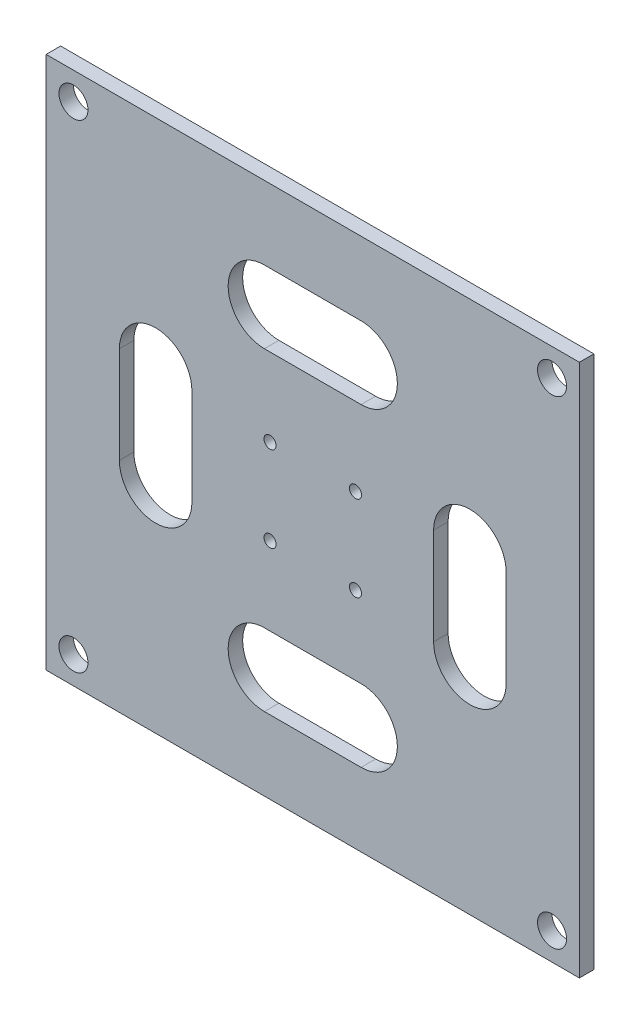
ISO-10303-21;
HEADER;
FILE_DESCRIPTION(('STEP AP214'),'2;1');
FILE_NAME('part.step','',(''),(''),'','','');
FILE_SCHEMA(('AUTOMOTIVE_DESIGN { 1 0 10303 214 1 1 1 1 }'));
ENDSEC;
DATA;
#1=APPLICATION_CONTEXT('core data for automotive mechanical design processes');
#2=APPLICATION_PROTOCOL_DEFINITION('international standard','automotive_design',2000,#1);
#3=PRODUCT_CONTEXT('',#1,'mechanical');
#4=PRODUCT('Part','Part','',(#3));
#5=PRODUCT_RELATED_PRODUCT_CATEGORY('part','',(#4));
#6=PRODUCT_DEFINITION_FORMATION('','',#4);
#7=PRODUCT_DEFINITION_CONTEXT('part definition',#1,'design');
#8=PRODUCT_DEFINITION('design','',#6,#7);
#9=PRODUCT_DEFINITION_SHAPE('','',#8);
#10=(LENGTH_UNIT() NAMED_UNIT(*) SI_UNIT(.MILLI.,.METRE.));
#11=(NAMED_UNIT(*) PLANE_ANGLE_UNIT() SI_UNIT($,.RADIAN.));
#12=(NAMED_UNIT(*) SI_UNIT($,.STERADIAN.) SOLID_ANGLE_UNIT());
#13=UNCERTAINTY_MEASURE_WITH_UNIT(LENGTH_MEASURE(1.E-05),#10,'distance_accuracy_value','');
#14=(GEOMETRIC_REPRESENTATION_CONTEXT(3) GLOBAL_UNCERTAINTY_ASSIGNED_CONTEXT((#13)) GLOBAL_UNIT_ASSIGNED_CONTEXT((#10,
#11,#12)) REPRESENTATION_CONTEXT('',''));
#15=CARTESIAN_POINT('',(0.,0.,0.));
#16=DIRECTION('',(0.,0.,1.));
#17=DIRECTION('',(1.,0.,0.));
#18=AXIS2_PLACEMENT_3D('',#15,#16,#17);
#19=CARTESIAN_POINT('',(0.,0.,3.));
#20=DIRECTION('',(0.,0.,1.));
#21=DIRECTION('',(1.,0.,0.));
#22=AXIS2_PLACEMENT_3D('',#19,#20,#21);
#23=PLANE('',#22);
#24=CARTESIAN_POINT('',(49.4974746830449,-49.4974746830718,3.));
#25=DIRECTION('',(0.,0.,1.));
#26=DIRECTION('',(1.,0.,0.));
#27=AXIS2_PLACEMENT_3D('',#24,#25,#26);
#28=CIRCLE('',#27,3.0000000000168);
#29=CARTESIAN_POINT('',(52.4974746830617,-49.4974746830718,3.));
#30=VERTEX_POINT('',#29);
#31=EDGE_CURVE('E311',#30,#30,#28,.T.);
#32=ORIENTED_EDGE('',*,*,#31,.F.);
#33=EDGE_LOOP('',(#32));
#34=FACE_BOUND('',#33,.T.);
#35=CARTESIAN_POINT('',(-49.4974746830448,49.4974746830718,3.));
#36=DIRECTION('',(0.,0.,1.));
#37=DIRECTION('',(1.,0.,0.));
#38=AXIS2_PLACEMENT_3D('',#35,#36,#37);
#39=CIRCLE('',#38,2.99999999998317);
#40=CARTESIAN_POINT('',(-46.4974746830617,49.4974746830718,3.));
#41=VERTEX_POINT('',#40);
#42=EDGE_CURVE('E323',#41,#41,#39,.T.);
#43=ORIENTED_EDGE('',*,*,#42,.F.);
#44=EDGE_LOOP('',(#43));
#45=FACE_BOUND('',#44,.T.);
#46=CARTESIAN_POINT('',(8.83883476483184,-8.83883476483195,3.));
#47=DIRECTION('',(0.,0.,1.));
#48=DIRECTION('',(1.,0.,0.));
#49=AXIS2_PLACEMENT_3D('',#46,#47,#48);
#50=CIRCLE('',#49,1.24999999999912);
#51=CARTESIAN_POINT('',(10.088834764831,-8.83883476483195,3.));
#52=VERTEX_POINT('',#51);
#53=EDGE_CURVE('E335',#52,#52,#50,.T.);
#54=ORIENTED_EDGE('',*,*,#53,.F.);
#55=EDGE_LOOP('',(#54));
#56=FACE_BOUND('',#55,.T.);
#57=CARTESIAN_POINT('',(-8.83883476483184,8.83883476483195,3.));
#58=DIRECTION('',(0.,0.,1.));
#59=DIRECTION('',(1.,0.,0.));
#60=AXIS2_PLACEMENT_3D('',#57,#58,#59);
#61=CIRCLE('',#60,1.25);
#62=CARTESIAN_POINT('',(-7.58883476483184,8.83883476483195,3.));
#63=VERTEX_POINT('',#62);
#64=EDGE_CURVE('E347',#63,#63,#61,.T.);
#65=ORIENTED_EDGE('',*,*,#64,.F.);
#66=EDGE_LOOP('',(#65));
#67=FACE_BOUND('',#66,.T.);
#68=DIRECTION('',(0.,1.,0.));
#69=VECTOR('',#68,1.);
#70=CARTESIAN_POINT('',(55.1543289325508,-55.1543289325506,3.));
#71=LINE('',#70,#69);
#72=CARTESIAN_POINT('',(55.1543289325508,-55.1543289325506,3.));
#73=VERTEX_POINT('',#72);
#74=CARTESIAN_POINT('',(55.1543289325506,55.1543289325508,3.));
#75=VERTEX_POINT('',#74);
#76=EDGE_CURVE('E353',#73,#75,#71,.T.);
#77=ORIENTED_EDGE('',*,*,#76,.T.);
#78=DIRECTION('',(-1.,0.,0.));
#79=VECTOR('',#78,1.);
#80=CARTESIAN_POINT('',(55.1543289325506,55.1543289325508,3.));
#81=LINE('',#80,#79);
#82=CARTESIAN_POINT('',(-55.1543289325508,55.1543289325506,3.));
#83=VERTEX_POINT('',#82);
#84=EDGE_CURVE('E356',#75,#83,#81,.T.);
#85=ORIENTED_EDGE('',*,*,#84,.T.);
#86=DIRECTION('',(0.,-1.,0.));
#87=VECTOR('',#86,1.);
#88=CARTESIAN_POINT('',(-55.1543289325508,55.1543289325506,3.));
#89=LINE('',#88,#87);
#90=CARTESIAN_POINT('',(-55.1543289325506,-55.1543289325508,3.));
#91=VERTEX_POINT('',#90);
#92=EDGE_CURVE('E359',#83,#91,#89,.T.);
#93=ORIENTED_EDGE('',*,*,#92,.T.);
#94=DIRECTION('',(1.,0.,0.));
#95=VECTOR('',#94,1.);
#96=CARTESIAN_POINT('',(-55.1543289325506,-55.1543289325508,3.));
#97=LINE('',#96,#95);
#98=EDGE_CURVE('E361',#91,#73,#97,.T.);
#99=ORIENTED_EDGE('',*,*,#98,.T.);
#100=EDGE_LOOP('',(#77,#85,#93,#99));
#101=FACE_BOUND('',#100,.T.);
#102=CARTESIAN_POINT('',(8.83883476483186,8.83883476483193,3.));
#103=DIRECTION('',(0.,0.,1.));
#104=DIRECTION('',(-1.,0.,0.));
#105=AXIS2_PLACEMENT_3D('',#102,#103,#104);
#106=CIRCLE('',#105,1.25);
#107=CARTESIAN_POINT('',(7.58883476483186,8.83883476483193,3.));
#108=VERTEX_POINT('',#107);
#109=EDGE_CURVE('E341',#108,#108,#106,.T.);
#110=ORIENTED_EDGE('',*,*,#109,.F.);
#111=EDGE_LOOP('',(#110));
#112=FACE_BOUND('',#111,.T.);
#113=CARTESIAN_POINT('',(-8.83883476483184,-8.83883476483195,3.));
#114=DIRECTION('',(0.,0.,1.));
#115=DIRECTION('',(-1.,0.,0.));
#116=AXIS2_PLACEMENT_3D('',#113,#114,#115);
#117=CIRCLE('',#116,1.25000000000086);
#118=CARTESIAN_POINT('',(-10.0888347648327,-8.83883476483195,3.));
#119=VERTEX_POINT('',#118);
#120=EDGE_CURVE('E329',#119,#119,#117,.T.);
#121=ORIENTED_EDGE('',*,*,#120,.F.);
#122=EDGE_LOOP('',(#121));
#123=FACE_BOUND('',#122,.T.);
#124=CARTESIAN_POINT('',(49.4974746830718,49.4974746830448,3.));
#125=DIRECTION('',(0.,0.,1.));
#126=DIRECTION('',(1.,0.,0.));
#127=AXIS2_PLACEMENT_3D('',#124,#125,#126);
#128=CIRCLE('',#127,2.99999999999104);
#129=CARTESIAN_POINT('',(52.4974746830628,49.4974746830448,3.));
#130=VERTEX_POINT('',#129);
#131=EDGE_CURVE('E317',#130,#130,#128,.T.);
#132=ORIENTED_EDGE('',*,*,#131,.F.);
#133=EDGE_LOOP('',(#132));
#134=FACE_BOUND('',#133,.T.);
#135=CARTESIAN_POINT('',(-49.4974746830718,-49.4974746830448,3.));
#136=DIRECTION('',(0.,0.,1.));
#137=DIRECTION('',(1.,0.,0.));
#138=AXIS2_PLACEMENT_3D('',#135,#136,#137);
#139=CIRCLE('',#138,3.00000000000891);
#140=CARTESIAN_POINT('',(-46.4974746830629,-49.4974746830448,3.));
#141=VERTEX_POINT('',#140);
#142=EDGE_CURVE('E305',#141,#141,#139,.T.);
#143=ORIENTED_EDGE('',*,*,#142,.F.);
#144=EDGE_LOOP('',(#143));
#145=FACE_BOUND('',#144,.T.);
#146=DIRECTION('',(0.,1.,0.));
#147=VECTOR('',#146,1.);
#148=CARTESIAN_POINT('',(-25.,-9.99999999999994,3.));
#149=LINE('',#148,#147);
#150=CARTESIAN_POINT('',(-25.,-9.99999999999994,3.));
#151=VERTEX_POINT('',#150);
#152=CARTESIAN_POINT('',(-25.,10.0000000000001,3.));
#153=VERTEX_POINT('',#152);
#154=EDGE_CURVE('E276',#151,#153,#149,.T.);
#155=ORIENTED_EDGE('',*,*,#154,.F.);
#156=CARTESIAN_POINT('',(-32.5,-9.99999999999992,3.));
#157=DIRECTION('',(0.,0.,1.));
#158=DIRECTION('',(-1.,0.,0.));
#159=AXIS2_PLACEMENT_3D('',#156,#157,#158);
#160=CIRCLE('',#159,7.5);
#161=CARTESIAN_POINT('',(-40.,-9.9999999999999,3.));
#162=VERTEX_POINT('',#161);
#163=EDGE_CURVE('E274',#162,#151,#160,.T.);
#164=ORIENTED_EDGE('',*,*,#163,.F.);
#165=DIRECTION('',(0.,-1.,0.));
#166=VECTOR('',#165,1.);
#167=CARTESIAN_POINT('',(-40.,-9.9999999999999,3.));
#168=LINE('',#167,#166);
#169=CARTESIAN_POINT('',(-40.,10.0000000000001,3.));
#170=VERTEX_POINT('',#169);
#171=EDGE_CURVE('E282',#170,#162,#168,.T.);
#172=ORIENTED_EDGE('',*,*,#171,.F.);
#173=CARTESIAN_POINT('',(-32.5,10.0000000000001,3.));
#174=DIRECTION('',(0.,0.,1.));
#175=DIRECTION('',(-1.,0.,0.));
#176=AXIS2_PLACEMENT_3D('',#173,#174,#175);
#177=CIRCLE('',#176,7.5);
#178=EDGE_CURVE('E279',#153,#170,#177,.T.);
#179=ORIENTED_EDGE('',*,*,#178,.F.);
#180=EDGE_LOOP('',(#155,#164,#172,#179));
#181=FACE_BOUND('',#180,.T.);
#182=DIRECTION('',(0.,1.,0.));
#183=VECTOR('',#182,1.);
#184=CARTESIAN_POINT('',(40.,-10.,3.));
#185=LINE('',#184,#183);
#186=CARTESIAN_POINT('',(40.,-10.,3.));
#187=VERTEX_POINT('',#186);
#188=CARTESIAN_POINT('',(40.,10.,3.));
#189=VERTEX_POINT('',#188);
#190=EDGE_CURVE('E245',#187,#189,#185,.T.);
#191=ORIENTED_EDGE('',*,*,#190,.F.);
#192=CARTESIAN_POINT('',(32.5,-10.,3.));
#193=DIRECTION('',(0.,0.,1.));
#194=DIRECTION('',(1.,0.,0.));
#195=AXIS2_PLACEMENT_3D('',#192,#193,#194);
#196=CIRCLE('',#195,7.5);
#197=CARTESIAN_POINT('',(25.,-10.,3.));
#198=VERTEX_POINT('',#197);
#199=EDGE_CURVE('E243',#198,#187,#196,.T.);
#200=ORIENTED_EDGE('',*,*,#199,.F.);
#201=DIRECTION('',(0.,-1.,0.));
#202=VECTOR('',#201,1.);
#203=CARTESIAN_POINT('',(25.,-10.,3.));
#204=LINE('',#203,#202);
#205=CARTESIAN_POINT('',(25.,10.,3.));
#206=VERTEX_POINT('',#205);
#207=EDGE_CURVE('E251',#206,#198,#204,.T.);
#208=ORIENTED_EDGE('',*,*,#207,.F.);
#209=CARTESIAN_POINT('',(32.5,10.,3.));
#210=DIRECTION('',(0.,0.,1.));
#211=DIRECTION('',(1.,0.,0.));
#212=AXIS2_PLACEMENT_3D('',#209,#210,#211);
#213=CIRCLE('',#212,7.5);
#214=EDGE_CURVE('E248',#189,#206,#213,.T.);
#215=ORIENTED_EDGE('',*,*,#214,.F.);
#216=EDGE_LOOP('',(#191,#200,#208,#215));
#217=FACE_BOUND('',#216,.T.);
#218=DIRECTION('',(1.,0.,0.));
#219=VECTOR('',#218,1.);
#220=CARTESIAN_POINT('',(-10.,25.0000000000001,3.));
#221=LINE('',#220,#219);
#222=CARTESIAN_POINT('',(-10.,25.0000000000001,3.));
#223=VERTEX_POINT('',#222);
#224=CARTESIAN_POINT('',(10.,25.0000000000001,3.));
#225=VERTEX_POINT('',#224);
#226=EDGE_CURVE('E214',#223,#225,#221,.T.);
#227=ORIENTED_EDGE('',*,*,#226,.F.);
#228=CARTESIAN_POINT('',(-10.,32.5000000000001,3.));
#229=DIRECTION('',(0.,0.,1.));
#230=DIRECTION('',(1.,0.,0.));
#231=AXIS2_PLACEMENT_3D('',#228,#229,#230);
#232=CIRCLE('',#231,7.5);
#233=CARTESIAN_POINT('',(-10.,40.0000000000001,3.));
#234=VERTEX_POINT('',#233);
#235=EDGE_CURVE('E212',#234,#223,#232,.T.);
#236=ORIENTED_EDGE('',*,*,#235,.F.);
#237=DIRECTION('',(-1.,0.,0.));
#238=VECTOR('',#237,1.);
#239=CARTESIAN_POINT('',(-10.,40.0000000000001,3.));
#240=LINE('',#239,#238);
#241=CARTESIAN_POINT('',(10.,40.0000000000001,3.));
#242=VERTEX_POINT('',#241);
#243=EDGE_CURVE('E220',#242,#234,#240,.T.);
#244=ORIENTED_EDGE('',*,*,#243,.F.);
#245=CARTESIAN_POINT('',(10.,32.5000000000001,3.));
#246=DIRECTION('',(0.,0.,1.));
#247=DIRECTION('',(1.,0.,0.));
#248=AXIS2_PLACEMENT_3D('',#245,#246,#247);
#249=CIRCLE('',#248,7.5);
#250=EDGE_CURVE('E217',#225,#242,#249,.T.);
#251=ORIENTED_EDGE('',*,*,#250,.F.);
#252=EDGE_LOOP('',(#227,#236,#244,#251));
#253=FACE_BOUND('',#252,.T.);
#254=DIRECTION('',(1.,0.,0.));
#255=VECTOR('',#254,1.);
#256=CARTESIAN_POINT('',(-10.,-40.0000000000001,3.));
#257=LINE('',#256,#255);
#258=CARTESIAN_POINT('',(-10.,-40.0000000000001,3.));
#259=VERTEX_POINT('',#258);
#260=CARTESIAN_POINT('',(10.,-40.0000000000001,3.));
#261=VERTEX_POINT('',#260);
#262=EDGE_CURVE('E184',#259,#261,#257,.T.);
#263=ORIENTED_EDGE('',*,*,#262,.F.);
#264=CARTESIAN_POINT('',(-10.,-32.5000000000001,3.));
#265=DIRECTION('',(0.,0.,1.));
#266=DIRECTION('',(-1.,0.,0.));
#267=AXIS2_PLACEMENT_3D('',#264,#265,#266);
#268=CIRCLE('',#267,7.5);
#269=CARTESIAN_POINT('',(-10.,-25.0000000000001,3.));
#270=VERTEX_POINT('',#269);
#271=EDGE_CURVE('E176',#270,#259,#268,.T.);
#272=ORIENTED_EDGE('',*,*,#271,.F.);
#273=DIRECTION('',(-1.,0.,0.));
#274=VECTOR('',#273,1.);
#275=CARTESIAN_POINT('',(-10.,-25.0000000000001,3.));
#276=LINE('',#275,#274);
#277=CARTESIAN_POINT('',(10.,-25.0000000000001,3.));
#278=VERTEX_POINT('',#277);
#279=EDGE_CURVE('E198',#278,#270,#276,.T.);
#280=ORIENTED_EDGE('',*,*,#279,.F.);
#281=CARTESIAN_POINT('',(10.,-32.5000000000001,3.));
#282=DIRECTION('',(0.,0.,1.));
#283=DIRECTION('',(-1.,0.,0.));
#284=AXIS2_PLACEMENT_3D('',#281,#282,#283);
#285=CIRCLE('',#284,7.5);
#286=EDGE_CURVE('E196',#261,#278,#285,.T.);
#287=ORIENTED_EDGE('',*,*,#286,.F.);
#288=EDGE_LOOP('',(#263,#272,#280,#287));
#289=FACE_BOUND('',#288,.T.);
#290=ADVANCED_FACE('F39',(#34,#45,#56,#67,#101,#112,#123,#134,#145,#181,#217,#253,#289),#23,.T.);
#291=CARTESIAN_POINT('',(0.,0.,0.));
#292=DIRECTION('',(0.,0.,1.));
#293=DIRECTION('',(1.,0.,0.));
#294=AXIS2_PLACEMENT_3D('',#291,#292,#293);
#295=PLANE('',#294);
#296=CARTESIAN_POINT('',(-10.,32.5000000000001,0.));
#297=DIRECTION('',(0.,0.,1.));
#298=DIRECTION('',(1.,0.,0.));
#299=AXIS2_PLACEMENT_3D('',#296,#297,#298);
#300=CIRCLE('',#299,7.5);
#301=CARTESIAN_POINT('',(-10.,40.0000000000001,0.));
#302=VERTEX_POINT('',#301);
#303=CARTESIAN_POINT('',(-10.,25.0000000000001,0.));
#304=VERTEX_POINT('',#303);
#305=EDGE_CURVE('E192',#302,#304,#300,.T.);
#306=ORIENTED_EDGE('',*,*,#305,.T.);
#307=DIRECTION('',(1.,0.,0.));
#308=VECTOR('',#307,1.);
#309=CARTESIAN_POINT('',(-10.,25.0000000000001,0.));
#310=LINE('',#309,#308);
#311=CARTESIAN_POINT('',(10.,25.0000000000001,0.));
#312=VERTEX_POINT('',#311);
#313=EDGE_CURVE('E225',#304,#312,#310,.T.);
#314=ORIENTED_EDGE('',*,*,#313,.T.);
#315=CARTESIAN_POINT('',(10.,32.5000000000001,0.));
#316=DIRECTION('',(0.,0.,1.));
#317=DIRECTION('',(1.,0.,0.));
#318=AXIS2_PLACEMENT_3D('',#315,#316,#317);
#319=CIRCLE('',#318,7.5);
#320=CARTESIAN_POINT('',(10.,40.0000000000001,0.));
#321=VERTEX_POINT('',#320);
#322=EDGE_CURVE('E228',#312,#321,#319,.T.);
#323=ORIENTED_EDGE('',*,*,#322,.T.);
#324=DIRECTION('',(-1.,0.,0.));
#325=VECTOR('',#324,1.);
#326=CARTESIAN_POINT('',(-10.,40.0000000000001,0.));
#327=LINE('',#326,#325);
#328=EDGE_CURVE('E215',#321,#302,#327,.T.);
#329=ORIENTED_EDGE('',*,*,#328,.T.);
#330=EDGE_LOOP('',(#306,#314,#323,#329));
#331=FACE_BOUND('',#330,.T.);
#332=CARTESIAN_POINT('',(-32.5,-9.99999999999992,0.));
#333=DIRECTION('',(0.,0.,1.));
#334=DIRECTION('',(-1.,0.,0.));
#335=AXIS2_PLACEMENT_3D('',#332,#333,#334);
#336=CIRCLE('',#335,7.5);
#337=CARTESIAN_POINT('',(-40.,-9.9999999999999,0.));
#338=VERTEX_POINT('',#337);
#339=CARTESIAN_POINT('',(-25.,-9.99999999999994,0.));
#340=VERTEX_POINT('',#339);
#341=EDGE_CURVE('E273',#338,#340,#336,.T.);
#342=ORIENTED_EDGE('',*,*,#341,.T.);
#343=DIRECTION('',(0.,1.,0.));
#344=VECTOR('',#343,1.);
#345=CARTESIAN_POINT('',(-25.,-9.99999999999994,0.));
#346=LINE('',#345,#344);
#347=CARTESIAN_POINT('',(-25.,10.0000000000001,0.));
#348=VERTEX_POINT('',#347);
#349=EDGE_CURVE('E287',#340,#348,#346,.T.);
#350=ORIENTED_EDGE('',*,*,#349,.T.);
#351=CARTESIAN_POINT('',(-32.5,10.0000000000001,0.));
#352=DIRECTION('',(0.,0.,1.));
#353=DIRECTION('',(-1.,0.,0.));
#354=AXIS2_PLACEMENT_3D('',#351,#352,#353);
#355=CIRCLE('',#354,7.5);
#356=CARTESIAN_POINT('',(-40.,10.0000000000001,0.));
#357=VERTEX_POINT('',#356);
#358=EDGE_CURVE('E290',#348,#357,#355,.T.);
#359=ORIENTED_EDGE('',*,*,#358,.T.);
#360=DIRECTION('',(0.,-1.,0.));
#361=VECTOR('',#360,1.);
#362=CARTESIAN_POINT('',(-40.,-9.9999999999999,0.));
#363=LINE('',#362,#361);
#364=EDGE_CURVE('E277',#357,#338,#363,.T.);
#365=ORIENTED_EDGE('',*,*,#364,.T.);
#366=EDGE_LOOP('',(#342,#350,#359,#365));
#367=FACE_BOUND('',#366,.T.);
#368=DIRECTION('',(0.,1.,0.));
#369=VECTOR('',#368,1.);
#370=CARTESIAN_POINT('',(55.1543289325508,-55.1543289325506,0.));
#371=LINE('',#370,#369);
#372=CARTESIAN_POINT('',(55.1543289325508,-55.1543289325506,0.));
#373=VERTEX_POINT('',#372);
#374=CARTESIAN_POINT('',(55.1543289325506,55.1543289325508,0.));
#375=VERTEX_POINT('',#374);
#376=EDGE_CURVE('E350',#373,#375,#371,.T.);
#377=ORIENTED_EDGE('',*,*,#376,.F.);
#378=DIRECTION('',(1.,0.,0.));
#379=VECTOR('',#378,1.);
#380=CARTESIAN_POINT('',(-55.1543289325506,-55.1543289325508,0.));
#381=LINE('',#380,#379);
#382=CARTESIAN_POINT('',(-55.1543289325506,-55.1543289325508,0.));
#383=VERTEX_POINT('',#382);
#384=EDGE_CURVE('E357',#383,#373,#381,.T.);
#385=ORIENTED_EDGE('',*,*,#384,.F.);
#386=DIRECTION('',(0.,-1.,0.));
#387=VECTOR('',#386,1.);
#388=CARTESIAN_POINT('',(-55.1543289325508,55.1543289325506,0.));
#389=LINE('',#388,#387);
#390=CARTESIAN_POINT('',(-55.1543289325508,55.1543289325506,0.));
#391=VERTEX_POINT('',#390);
#392=EDGE_CURVE('E368',#391,#383,#389,.T.);
#393=ORIENTED_EDGE('',*,*,#392,.F.);
#394=DIRECTION('',(-1.,0.,0.));
#395=VECTOR('',#394,1.);
#396=CARTESIAN_POINT('',(55.1543289325506,55.1543289325508,0.));
#397=LINE('',#396,#395);
#398=EDGE_CURVE('E366',#375,#391,#397,.T.);
#399=ORIENTED_EDGE('',*,*,#398,.F.);
#400=EDGE_LOOP('',(#377,#385,#393,#399));
#401=FACE_BOUND('',#400,.T.);
#402=CARTESIAN_POINT('',(-8.83883476483184,8.83883476483195,0.));
#403=DIRECTION('',(0.,0.,1.));
#404=DIRECTION('',(1.,0.,0.));
#405=AXIS2_PLACEMENT_3D('',#402,#403,#404);
#406=CIRCLE('',#405,1.25);
#407=CARTESIAN_POINT('',(-7.58883476483184,8.83883476483195,0.));
#408=VERTEX_POINT('',#407);
#409=EDGE_CURVE('E344',#408,#408,#406,.T.);
#410=ORIENTED_EDGE('',*,*,#409,.T.);
#411=EDGE_LOOP('',(#410));
#412=FACE_BOUND('',#411,.T.);
#413=CARTESIAN_POINT('',(8.83883476483186,8.83883476483193,0.));
#414=DIRECTION('',(0.,0.,1.));
#415=DIRECTION('',(-1.,0.,0.));
#416=AXIS2_PLACEMENT_3D('',#413,#414,#415);
#417=CIRCLE('',#416,1.25);
#418=CARTESIAN_POINT('',(7.58883476483186,8.83883476483193,0.));
#419=VERTEX_POINT('',#418);
#420=EDGE_CURVE('E338',#419,#419,#417,.T.);
#421=ORIENTED_EDGE('',*,*,#420,.T.);
#422=EDGE_LOOP('',(#421));
#423=FACE_BOUND('',#422,.T.);
#424=CARTESIAN_POINT('',(8.83883476483184,-8.83883476483195,0.));
#425=DIRECTION('',(0.,0.,1.));
#426=DIRECTION('',(1.,0.,0.));
#427=AXIS2_PLACEMENT_3D('',#424,#425,#426);
#428=CIRCLE('',#427,1.24999999999912);
#429=CARTESIAN_POINT('',(10.088834764831,-8.83883476483195,0.));
#430=VERTEX_POINT('',#429);
#431=EDGE_CURVE('E332',#430,#430,#428,.T.);
#432=ORIENTED_EDGE('',*,*,#431,.T.);
#433=EDGE_LOOP('',(#432));
#434=FACE_BOUND('',#433,.T.);
#435=CARTESIAN_POINT('',(-8.83883476483184,-8.83883476483195,0.));
#436=DIRECTION('',(0.,0.,1.));
#437=DIRECTION('',(-1.,0.,0.));
#438=AXIS2_PLACEMENT_3D('',#435,#436,#437);
#439=CIRCLE('',#438,1.25000000000086);
#440=CARTESIAN_POINT('',(-10.0888347648327,-8.83883476483195,0.));
#441=VERTEX_POINT('',#440);
#442=EDGE_CURVE('E326',#441,#441,#439,.T.);
#443=ORIENTED_EDGE('',*,*,#442,.T.);
#444=EDGE_LOOP('',(#443));
#445=FACE_BOUND('',#444,.T.);
#446=CARTESIAN_POINT('',(-49.4974746830448,49.4974746830718,0.));
#447=DIRECTION('',(0.,0.,1.));
#448=DIRECTION('',(1.,0.,0.));
#449=AXIS2_PLACEMENT_3D('',#446,#447,#448);
#450=CIRCLE('',#449,2.99999999998317);
#451=CARTESIAN_POINT('',(-46.4974746830617,49.4974746830718,0.));
#452=VERTEX_POINT('',#451);
#453=EDGE_CURVE('E320',#452,#452,#450,.T.);
#454=ORIENTED_EDGE('',*,*,#453,.T.);
#455=EDGE_LOOP('',(#454));
#456=FACE_BOUND('',#455,.T.);
#457=CARTESIAN_POINT('',(49.4974746830718,49.4974746830448,0.));
#458=DIRECTION('',(0.,0.,1.));
#459=DIRECTION('',(1.,0.,0.));
#460=AXIS2_PLACEMENT_3D('',#457,#458,#459);
#461=CIRCLE('',#460,2.99999999999104);
#462=CARTESIAN_POINT('',(52.4974746830628,49.4974746830448,0.));
#463=VERTEX_POINT('',#462);
#464=EDGE_CURVE('E314',#463,#463,#461,.T.);
#465=ORIENTED_EDGE('',*,*,#464,.T.);
#466=EDGE_LOOP('',(#465));
#467=FACE_BOUND('',#466,.T.);
#468=CARTESIAN_POINT('',(49.4974746830449,-49.4974746830718,0.));
#469=DIRECTION('',(0.,0.,1.));
#470=DIRECTION('',(1.,0.,0.));
#471=AXIS2_PLACEMENT_3D('',#468,#469,#470);
#472=CIRCLE('',#471,3.0000000000168);
#473=CARTESIAN_POINT('',(52.4974746830617,-49.4974746830718,0.));
#474=VERTEX_POINT('',#473);
#475=EDGE_CURVE('E308',#474,#474,#472,.T.);
#476=ORIENTED_EDGE('',*,*,#475,.T.);
#477=EDGE_LOOP('',(#476));
#478=FACE_BOUND('',#477,.T.);
#479=CARTESIAN_POINT('',(-49.4974746830718,-49.4974746830448,0.));
#480=DIRECTION('',(0.,0.,1.));
#481=DIRECTION('',(1.,0.,0.));
#482=AXIS2_PLACEMENT_3D('',#479,#480,#481);
#483=CIRCLE('',#482,3.00000000000891);
#484=CARTESIAN_POINT('',(-46.4974746830629,-49.4974746830448,0.));
#485=VERTEX_POINT('',#484);
#486=EDGE_CURVE('E304',#485,#485,#483,.T.);
#487=ORIENTED_EDGE('',*,*,#486,.T.);
#488=EDGE_LOOP('',(#487));
#489=FACE_BOUND('',#488,.T.);
#490=CARTESIAN_POINT('',(32.5,-10.,0.));
#491=DIRECTION('',(0.,0.,1.));
#492=DIRECTION('',(1.,0.,0.));
#493=AXIS2_PLACEMENT_3D('',#490,#491,#492);
#494=CIRCLE('',#493,7.5);
#495=CARTESIAN_POINT('',(25.,-10.,0.));
#496=VERTEX_POINT('',#495);
#497=CARTESIAN_POINT('',(40.,-10.,0.));
#498=VERTEX_POINT('',#497);
#499=EDGE_CURVE('E242',#496,#498,#494,.T.);
#500=ORIENTED_EDGE('',*,*,#499,.T.);
#501=DIRECTION('',(0.,1.,0.));
#502=VECTOR('',#501,1.);
#503=CARTESIAN_POINT('',(40.,-10.,0.));
#504=LINE('',#503,#502);
#505=CARTESIAN_POINT('',(40.,10.,0.));
#506=VERTEX_POINT('',#505);
#507=EDGE_CURVE('E256',#498,#506,#504,.T.);
#508=ORIENTED_EDGE('',*,*,#507,.T.);
#509=CARTESIAN_POINT('',(32.5,10.,0.));
#510=DIRECTION('',(0.,0.,1.));
#511=DIRECTION('',(1.,0.,0.));
#512=AXIS2_PLACEMENT_3D('',#509,#510,#511);
#513=CIRCLE('',#512,7.5);
#514=CARTESIAN_POINT('',(25.,10.,0.));
#515=VERTEX_POINT('',#514);
#516=EDGE_CURVE('E259',#506,#515,#513,.T.);
#517=ORIENTED_EDGE('',*,*,#516,.T.);
#518=DIRECTION('',(0.,-1.,0.));
#519=VECTOR('',#518,1.);
#520=CARTESIAN_POINT('',(25.,-10.,0.));
#521=LINE('',#520,#519);
#522=EDGE_CURVE('E246',#515,#496,#521,.T.);
#523=ORIENTED_EDGE('',*,*,#522,.T.);
#524=EDGE_LOOP('',(#500,#508,#517,#523));
#525=FACE_BOUND('',#524,.T.);
#526=CARTESIAN_POINT('',(-10.,-32.5000000000001,0.));
#527=DIRECTION('',(0.,0.,1.));
#528=DIRECTION('',(-1.,0.,0.));
#529=AXIS2_PLACEMENT_3D('',#526,#527,#528);
#530=CIRCLE('',#529,7.5);
#531=CARTESIAN_POINT('',(-10.,-25.0000000000001,0.));
#532=VERTEX_POINT('',#531);
#533=CARTESIAN_POINT('',(-10.,-40.0000000000001,0.));
#534=VERTEX_POINT('',#533);
#535=EDGE_CURVE('E62',#532,#534,#530,.T.);
#536=ORIENTED_EDGE('',*,*,#535,.T.);
#537=DIRECTION('',(1.,0.,0.));
#538=VECTOR('',#537,1.);
#539=CARTESIAN_POINT('',(-10.,-40.0000000000001,0.));
#540=LINE('',#539,#538);
#541=CARTESIAN_POINT('',(10.,-40.0000000000001,0.));
#542=VERTEX_POINT('',#541);
#543=EDGE_CURVE('E191',#534,#542,#540,.T.);
#544=ORIENTED_EDGE('',*,*,#543,.T.);
#545=CARTESIAN_POINT('',(10.,-32.5000000000001,0.));
#546=DIRECTION('',(0.,0.,1.));
#547=DIRECTION('',(-1.,0.,0.));
#548=AXIS2_PLACEMENT_3D('',#545,#546,#547);
#549=CIRCLE('',#548,7.5);
#550=CARTESIAN_POINT('',(10.,-25.0000000000001,0.));
#551=VERTEX_POINT('',#550);
#552=EDGE_CURVE('E204',#542,#551,#549,.T.);
#553=ORIENTED_EDGE('',*,*,#552,.T.);
#554=DIRECTION('',(-1.,0.,0.));
#555=VECTOR('',#554,1.);
#556=CARTESIAN_POINT('',(-10.,-25.0000000000001,0.));
#557=LINE('',#556,#555);
#558=EDGE_CURVE('E185',#551,#532,#557,.T.);
#559=ORIENTED_EDGE('',*,*,#558,.T.);
#560=EDGE_LOOP('',(#536,#544,#553,#559));
#561=FACE_BOUND('',#560,.T.);
#562=ADVANCED_FACE('F386',(#331,#367,#401,#412,#423,#434,#445,#456,#467,#478,#489,#525,#561),
#295,.F.);
#563=CARTESIAN_POINT('',(55.1543289325508,-55.1543289325506,3.));
#564=DIRECTION('',(-1.,0.,0.));
#565=DIRECTION('',(0.,-1.,0.));
#566=AXIS2_PLACEMENT_3D('',#563,#564,#565);
#567=PLANE('',#566);
#568=ORIENTED_EDGE('',*,*,#376,.T.);
#569=DIRECTION('',(0.,0.,-1.));
#570=VECTOR('',#569,1.);
#571=CARTESIAN_POINT('',(55.1543289325506,55.1543289325508,3.));
#572=LINE('',#571,#570);
#573=EDGE_CURVE('E11',#75,#375,#572,.T.);
#574=ORIENTED_EDGE('',*,*,#573,.F.);
#575=ORIENTED_EDGE('',*,*,#76,.F.);
#576=DIRECTION('',(0.,0.,-1.));
#577=VECTOR('',#576,1.);
#578=CARTESIAN_POINT('',(55.1543289325508,-55.1543289325506,3.));
#579=LINE('',#578,#577);
#580=EDGE_CURVE('E363',#73,#373,#579,.T.);
#581=ORIENTED_EDGE('',*,*,#580,.T.);
#582=EDGE_LOOP('',(#568,#574,#575,#581));
#583=FACE_BOUND('',#582,.T.);
#584=ADVANCED_FACE('F41',(#583),#567,.F.);
#585=CARTESIAN_POINT('',(55.1543289325506,55.1543289325508,3.));
#586=DIRECTION('',(0.,-1.,0.));
#587=DIRECTION('',(1.,0.,0.));
#588=AXIS2_PLACEMENT_3D('',#585,#586,#587);
#589=PLANE('',#588);
#590=ORIENTED_EDGE('',*,*,#398,.T.);
#591=DIRECTION('',(0.,0.,-1.));
#592=VECTOR('',#591,1.);
#593=CARTESIAN_POINT('',(-55.1543289325508,55.1543289325506,3.));
#594=LINE('',#593,#592);
#595=EDGE_CURVE('E47',#83,#391,#594,.T.);
#596=ORIENTED_EDGE('',*,*,#595,.F.);
#597=ORIENTED_EDGE('',*,*,#84,.F.);
#598=ORIENTED_EDGE('',*,*,#573,.T.);
#599=EDGE_LOOP('',(#590,#596,#597,#598));
#600=FACE_BOUND('',#599,.T.);
#601=ADVANCED_FACE('F397',(#600),#589,.F.);
#602=CARTESIAN_POINT('',(-55.1543289325508,55.1543289325506,3.));
#603=DIRECTION('',(1.,0.,0.));
#604=DIRECTION('',(0.,1.,0.));
#605=AXIS2_PLACEMENT_3D('',#602,#603,#604);
#606=PLANE('',#605);
#607=ORIENTED_EDGE('',*,*,#392,.T.);
#608=DIRECTION('',(0.,0.,-1.));
#609=VECTOR('',#608,1.);
#610=CARTESIAN_POINT('',(-55.1543289325506,-55.1543289325508,3.));
#611=LINE('',#610,#609);
#612=EDGE_CURVE('E373',#91,#383,#611,.T.);
#613=ORIENTED_EDGE('',*,*,#612,.F.);
#614=ORIENTED_EDGE('',*,*,#92,.F.);
#615=ORIENTED_EDGE('',*,*,#595,.T.);
#616=EDGE_LOOP('',(#607,#613,#614,#615));
#617=FACE_BOUND('',#616,.T.);
#618=ADVANCED_FACE('F380',(#617),#606,.F.);
#619=CARTESIAN_POINT('',(-55.1543289325506,-55.1543289325508,3.));
#620=DIRECTION('',(0.,1.,0.));
#621=DIRECTION('',(-1.,0.,0.));
#622=AXIS2_PLACEMENT_3D('',#619,#620,#621);
#623=PLANE('',#622);
#624=ORIENTED_EDGE('',*,*,#384,.T.);
#625=ORIENTED_EDGE('',*,*,#580,.F.);
#626=ORIENTED_EDGE('',*,*,#98,.F.);
#627=ORIENTED_EDGE('',*,*,#612,.T.);
#628=EDGE_LOOP('',(#624,#625,#626,#627));
#629=FACE_BOUND('',#628,.T.);
#630=ADVANCED_FACE('F390',(#629),#623,.F.);
#631=CARTESIAN_POINT('',(-8.83883476483184,8.83883476483195,3.));
#632=DIRECTION('',(0.,0.,-1.));
#633=DIRECTION('',(-1.,0.,0.));
#634=AXIS2_PLACEMENT_3D('',#631,#632,#633);
#635=CYLINDRICAL_SURFACE('',#634,1.25);
#636=ORIENTED_EDGE('',*,*,#64,.T.);
#637=EDGE_LOOP('',(#636));
#638=FACE_BOUND('',#637,.T.);
#639=ORIENTED_EDGE('',*,*,#409,.F.);
#640=EDGE_LOOP('',(#639));
#641=FACE_BOUND('',#640,.T.);
#642=ADVANCED_FACE('F415',(#638,#641),#635,.F.);
#643=CARTESIAN_POINT('',(8.83883476483186,8.83883476483193,3.));
#644=DIRECTION('',(0.,0.,-1.));
#645=DIRECTION('',(-1.,0.,0.));
#646=AXIS2_PLACEMENT_3D('',#643,#644,#645);
#647=CYLINDRICAL_SURFACE('',#646,1.25);
#648=ORIENTED_EDGE('',*,*,#109,.T.);
#649=EDGE_LOOP('',(#648));
#650=FACE_BOUND('',#649,.T.);
#651=ORIENTED_EDGE('',*,*,#420,.F.);
#652=EDGE_LOOP('',(#651));
#653=FACE_BOUND('',#652,.T.);
#654=ADVANCED_FACE('F422',(#650,#653),#647,.F.);
#655=CARTESIAN_POINT('',(8.83883476483184,-8.83883476483195,3.));
#656=DIRECTION('',(0.,0.,-1.));
#657=DIRECTION('',(-1.,0.,0.));
#658=AXIS2_PLACEMENT_3D('',#655,#656,#657);
#659=CYLINDRICAL_SURFACE('',#658,1.24999999999912);
#660=ORIENTED_EDGE('',*,*,#53,.T.);
#661=EDGE_LOOP('',(#660));
#662=FACE_BOUND('',#661,.T.);
#663=ORIENTED_EDGE('',*,*,#431,.F.);
#664=EDGE_LOOP('',(#663));
#665=FACE_BOUND('',#664,.T.);
#666=ADVANCED_FACE('F427',(#662,#665),#659,.F.);
#667=CARTESIAN_POINT('',(-8.83883476483184,-8.83883476483195,3.));
#668=DIRECTION('',(0.,0.,-1.));
#669=DIRECTION('',(-1.,0.,0.));
#670=AXIS2_PLACEMENT_3D('',#667,#668,#669);
#671=CYLINDRICAL_SURFACE('',#670,1.25000000000086);
#672=ORIENTED_EDGE('',*,*,#120,.T.);
#673=EDGE_LOOP('',(#672));
#674=FACE_BOUND('',#673,.T.);
#675=ORIENTED_EDGE('',*,*,#442,.F.);
#676=EDGE_LOOP('',(#675));
#677=FACE_BOUND('',#676,.T.);
#678=ADVANCED_FACE('F526',(#674,#677),#671,.F.);
#679=CARTESIAN_POINT('',(-49.4974746830448,49.4974746830718,3.));
#680=DIRECTION('',(0.,0.,-1.));
#681=DIRECTION('',(-1.,0.,0.));
#682=AXIS2_PLACEMENT_3D('',#679,#680,#681);
#683=CYLINDRICAL_SURFACE('',#682,2.99999999998317);
#684=ORIENTED_EDGE('',*,*,#42,.T.);
#685=EDGE_LOOP('',(#684));
#686=FACE_BOUND('',#685,.T.);
#687=ORIENTED_EDGE('',*,*,#453,.F.);
#688=EDGE_LOOP('',(#687));
#689=FACE_BOUND('',#688,.T.);
#690=ADVANCED_FACE('F522',(#686,#689),#683,.F.);
#691=CARTESIAN_POINT('',(49.4974746830718,49.4974746830448,3.));
#692=DIRECTION('',(0.,0.,-1.));
#693=DIRECTION('',(-1.,0.,0.));
#694=AXIS2_PLACEMENT_3D('',#691,#692,#693);
#695=CYLINDRICAL_SURFACE('',#694,2.99999999999104);
#696=ORIENTED_EDGE('',*,*,#131,.T.);
#697=EDGE_LOOP('',(#696));
#698=FACE_BOUND('',#697,.T.);
#699=ORIENTED_EDGE('',*,*,#464,.F.);
#700=EDGE_LOOP('',(#699));
#701=FACE_BOUND('',#700,.T.);
#702=ADVANCED_FACE('F518',(#698,#701),#695,.F.);
#703=CARTESIAN_POINT('',(49.4974746830449,-49.4974746830718,3.));
#704=DIRECTION('',(0.,0.,-1.));
#705=DIRECTION('',(-1.,0.,0.));
#706=AXIS2_PLACEMENT_3D('',#703,#704,#705);
#707=CYLINDRICAL_SURFACE('',#706,3.0000000000168);
#708=ORIENTED_EDGE('',*,*,#31,.T.);
#709=EDGE_LOOP('',(#708));
#710=FACE_BOUND('',#709,.T.);
#711=ORIENTED_EDGE('',*,*,#475,.F.);
#712=EDGE_LOOP('',(#711));
#713=FACE_BOUND('',#712,.T.);
#714=ADVANCED_FACE('F514',(#710,#713),#707,.F.);
#715=CARTESIAN_POINT('',(-49.4974746830718,-49.4974746830448,3.));
#716=DIRECTION('',(0.,0.,-1.));
#717=DIRECTION('',(-1.,0.,0.));
#718=AXIS2_PLACEMENT_3D('',#715,#716,#717);
#719=CYLINDRICAL_SURFACE('',#718,3.00000000000891);
#720=ORIENTED_EDGE('',*,*,#142,.T.);
#721=EDGE_LOOP('',(#720));
#722=FACE_BOUND('',#721,.T.);
#723=ORIENTED_EDGE('',*,*,#486,.F.);
#724=EDGE_LOOP('',(#723));
#725=FACE_BOUND('',#724,.T.);
#726=ADVANCED_FACE('F510',(#722,#725),#719,.F.);
#727=CARTESIAN_POINT('',(-32.5,-9.99999999999992,3.));
#728=DIRECTION('',(0.,0.,-1.));
#729=DIRECTION('',(-1.,0.,0.));
#730=AXIS2_PLACEMENT_3D('',#727,#728,#729);
#731=CYLINDRICAL_SURFACE('',#730,7.5);
#732=ORIENTED_EDGE('',*,*,#341,.F.);
#733=DIRECTION('',(0.,0.,-1.));
#734=VECTOR('',#733,1.);
#735=CARTESIAN_POINT('',(-40.,-9.9999999999999,3.));
#736=LINE('',#735,#734);
#737=EDGE_CURVE('E284',#162,#338,#736,.T.);
#738=ORIENTED_EDGE('',*,*,#737,.F.);
#739=ORIENTED_EDGE('',*,*,#163,.T.);
#740=DIRECTION('',(0.,0.,-1.));
#741=VECTOR('',#740,1.);
#742=CARTESIAN_POINT('',(-25.,-9.99999999999994,3.));
#743=LINE('',#742,#741);
#744=EDGE_CURVE('E301',#151,#340,#743,.T.);
#745=ORIENTED_EDGE('',*,*,#744,.T.);
#746=EDGE_LOOP('',(#732,#738,#739,#745));
#747=FACE_BOUND('',#746,.T.);
#748=ADVANCED_FACE('F506',(#747),#731,.F.);
#749=CARTESIAN_POINT('',(-25.,-9.99999999999994,3.));
#750=DIRECTION('',(-1.,0.,0.));
#751=DIRECTION('',(0.,-1.,0.));
#752=AXIS2_PLACEMENT_3D('',#749,#750,#751);
#753=PLANE('',#752);
#754=ORIENTED_EDGE('',*,*,#349,.F.);
#755=ORIENTED_EDGE('',*,*,#744,.F.);
#756=ORIENTED_EDGE('',*,*,#154,.T.);
#757=DIRECTION('',(0.,0.,-1.));
#758=VECTOR('',#757,1.);
#759=CARTESIAN_POINT('',(-25.,10.0000000000001,3.));
#760=LINE('',#759,#758);
#761=EDGE_CURVE('E299',#153,#348,#760,.T.);
#762=ORIENTED_EDGE('',*,*,#761,.T.);
#763=EDGE_LOOP('',(#754,#755,#756,#762));
#764=FACE_BOUND('',#763,.T.);
#765=ADVANCED_FACE('F502',(#764),#753,.T.);
#766=CARTESIAN_POINT('',(-32.5,10.0000000000001,3.));
#767=DIRECTION('',(0.,0.,-1.));
#768=DIRECTION('',(-1.,0.,0.));
#769=AXIS2_PLACEMENT_3D('',#766,#767,#768);
#770=CYLINDRICAL_SURFACE('',#769,7.5);
#771=ORIENTED_EDGE('',*,*,#358,.F.);
#772=ORIENTED_EDGE('',*,*,#761,.F.);
#773=ORIENTED_EDGE('',*,*,#178,.T.);
#774=DIRECTION('',(0.,0.,-1.));
#775=VECTOR('',#774,1.);
#776=CARTESIAN_POINT('',(-40.,10.0000000000001,3.));
#777=LINE('',#776,#775);
#778=EDGE_CURVE('E297',#170,#357,#777,.T.);
#779=ORIENTED_EDGE('',*,*,#778,.T.);
#780=EDGE_LOOP('',(#771,#772,#773,#779));
#781=FACE_BOUND('',#780,.T.);
#782=ADVANCED_FACE('F498',(#781),#770,.F.);
#783=CARTESIAN_POINT('',(-40.,-9.9999999999999,3.));
#784=DIRECTION('',(1.,0.,0.));
#785=DIRECTION('',(0.,1.,0.));
#786=AXIS2_PLACEMENT_3D('',#783,#784,#785);
#787=PLANE('',#786);
#788=ORIENTED_EDGE('',*,*,#364,.F.);
#789=ORIENTED_EDGE('',*,*,#778,.F.);
#790=ORIENTED_EDGE('',*,*,#171,.T.);
#791=ORIENTED_EDGE('',*,*,#737,.T.);
#792=EDGE_LOOP('',(#788,#789,#790,#791));
#793=FACE_BOUND('',#792,.T.);
#794=ADVANCED_FACE('F494',(#793),#787,.T.);
#795=CARTESIAN_POINT('',(32.5,-10.,3.));
#796=DIRECTION('',(0.,0.,-1.));
#797=DIRECTION('',(-1.,0.,0.));
#798=AXIS2_PLACEMENT_3D('',#795,#796,#797);
#799=CYLINDRICAL_SURFACE('',#798,7.5);
#800=ORIENTED_EDGE('',*,*,#499,.F.);
#801=DIRECTION('',(0.,0.,-1.));
#802=VECTOR('',#801,1.);
#803=CARTESIAN_POINT('',(25.,-10.,3.));
#804=LINE('',#803,#802);
#805=EDGE_CURVE('E253',#198,#496,#804,.T.);
#806=ORIENTED_EDGE('',*,*,#805,.F.);
#807=ORIENTED_EDGE('',*,*,#199,.T.);
#808=DIRECTION('',(0.,0.,-1.));
#809=VECTOR('',#808,1.);
#810=CARTESIAN_POINT('',(40.,-10.,3.));
#811=LINE('',#810,#809);
#812=EDGE_CURVE('E270',#187,#498,#811,.T.);
#813=ORIENTED_EDGE('',*,*,#812,.T.);
#814=EDGE_LOOP('',(#800,#806,#807,#813));
#815=FACE_BOUND('',#814,.T.);
#816=ADVANCED_FACE('F490',(#815),#799,.F.);
#817=CARTESIAN_POINT('',(40.,-10.,3.));
#818=DIRECTION('',(-1.,0.,0.));
#819=DIRECTION('',(0.,-1.,0.));
#820=AXIS2_PLACEMENT_3D('',#817,#818,#819);
#821=PLANE('',#820);
#822=ORIENTED_EDGE('',*,*,#507,.F.);
#823=ORIENTED_EDGE('',*,*,#812,.F.);
#824=ORIENTED_EDGE('',*,*,#190,.T.);
#825=DIRECTION('',(0.,0.,-1.));
#826=VECTOR('',#825,1.);
#827=CARTESIAN_POINT('',(40.,10.,3.));
#828=LINE('',#827,#826);
#829=EDGE_CURVE('E268',#189,#506,#828,.T.);
#830=ORIENTED_EDGE('',*,*,#829,.T.);
#831=EDGE_LOOP('',(#822,#823,#824,#830));
#832=FACE_BOUND('',#831,.T.);
#833=ADVANCED_FACE('F486',(#832),#821,.T.);
#834=CARTESIAN_POINT('',(32.5,10.,3.));
#835=DIRECTION('',(0.,0.,-1.));
#836=DIRECTION('',(-1.,0.,0.));
#837=AXIS2_PLACEMENT_3D('',#834,#835,#836);
#838=CYLINDRICAL_SURFACE('',#837,7.5);
#839=ORIENTED_EDGE('',*,*,#516,.F.);
#840=ORIENTED_EDGE('',*,*,#829,.F.);
#841=ORIENTED_EDGE('',*,*,#214,.T.);
#842=DIRECTION('',(0.,0.,-1.));
#843=VECTOR('',#842,1.);
#844=CARTESIAN_POINT('',(25.,10.,3.));
#845=LINE('',#844,#843);
#846=EDGE_CURVE('E266',#206,#515,#845,.T.);
#847=ORIENTED_EDGE('',*,*,#846,.T.);
#848=EDGE_LOOP('',(#839,#840,#841,#847));
#849=FACE_BOUND('',#848,.T.);
#850=ADVANCED_FACE('F482',(#849),#838,.F.);
#851=CARTESIAN_POINT('',(25.,-10.,3.));
#852=DIRECTION('',(1.,0.,0.));
#853=DIRECTION('',(0.,1.,0.));
#854=AXIS2_PLACEMENT_3D('',#851,#852,#853);
#855=PLANE('',#854);
#856=ORIENTED_EDGE('',*,*,#522,.F.);
#857=ORIENTED_EDGE('',*,*,#846,.F.);
#858=ORIENTED_EDGE('',*,*,#207,.T.);
#859=ORIENTED_EDGE('',*,*,#805,.T.);
#860=EDGE_LOOP('',(#856,#857,#858,#859));
#861=FACE_BOUND('',#860,.T.);
#862=ADVANCED_FACE('F478',(#861),#855,.T.);
#863=CARTESIAN_POINT('',(-10.,32.5000000000001,3.));
#864=DIRECTION('',(0.,0.,-1.));
#865=DIRECTION('',(-1.,0.,0.));
#866=AXIS2_PLACEMENT_3D('',#863,#864,#865);
#867=CYLINDRICAL_SURFACE('',#866,7.5);
#868=ORIENTED_EDGE('',*,*,#305,.F.);
#869=DIRECTION('',(0.,0.,-1.));
#870=VECTOR('',#869,1.);
#871=CARTESIAN_POINT('',(-10.,40.0000000000001,3.));
#872=LINE('',#871,#870);
#873=EDGE_CURVE('E222',#234,#302,#872,.T.);
#874=ORIENTED_EDGE('',*,*,#873,.F.);
#875=ORIENTED_EDGE('',*,*,#235,.T.);
#876=DIRECTION('',(0.,0.,-1.));
#877=VECTOR('',#876,1.);
#878=CARTESIAN_POINT('',(-10.,25.0000000000001,3.));
#879=LINE('',#878,#877);
#880=EDGE_CURVE('E239',#223,#304,#879,.T.);
#881=ORIENTED_EDGE('',*,*,#880,.T.);
#882=EDGE_LOOP('',(#868,#874,#875,#881));
#883=FACE_BOUND('',#882,.T.);
#884=ADVANCED_FACE('F474',(#883),#867,.F.);
#885=CARTESIAN_POINT('',(-10.,25.0000000000001,3.));
#886=DIRECTION('',(0.,1.,0.));
#887=DIRECTION('',(0.,0.,1.));
#888=AXIS2_PLACEMENT_3D('',#885,#886,#887);
#889=PLANE('',#888);
#890=ORIENTED_EDGE('',*,*,#313,.F.);
#891=ORIENTED_EDGE('',*,*,#880,.F.);
#892=ORIENTED_EDGE('',*,*,#226,.T.);
#893=DIRECTION('',(0.,0.,-1.));
#894=VECTOR('',#893,1.);
#895=CARTESIAN_POINT('',(10.,25.0000000000001,3.));
#896=LINE('',#895,#894);
#897=EDGE_CURVE('E237',#225,#312,#896,.T.);
#898=ORIENTED_EDGE('',*,*,#897,.T.);
#899=EDGE_LOOP('',(#890,#891,#892,#898));
#900=FACE_BOUND('',#899,.T.);
#901=ADVANCED_FACE('F470',(#900),#889,.T.);
#902=CARTESIAN_POINT('',(10.,32.5000000000001,3.));
#903=DIRECTION('',(0.,0.,-1.));
#904=DIRECTION('',(-1.,0.,0.));
#905=AXIS2_PLACEMENT_3D('',#902,#903,#904);
#906=CYLINDRICAL_SURFACE('',#905,7.5);
#907=ORIENTED_EDGE('',*,*,#322,.F.);
#908=ORIENTED_EDGE('',*,*,#897,.F.);
#909=ORIENTED_EDGE('',*,*,#250,.T.);
#910=DIRECTION('',(0.,0.,-1.));
#911=VECTOR('',#910,1.);
#912=CARTESIAN_POINT('',(10.,40.0000000000001,3.));
#913=LINE('',#912,#911);
#914=EDGE_CURVE('E235',#242,#321,#913,.T.);
#915=ORIENTED_EDGE('',*,*,#914,.T.);
#916=EDGE_LOOP('',(#907,#908,#909,#915));
#917=FACE_BOUND('',#916,.T.);
#918=ADVANCED_FACE('F466',(#917),#906,.F.);
#919=CARTESIAN_POINT('',(-10.,40.0000000000001,3.));
#920=DIRECTION('',(0.,-1.,0.));
#921=DIRECTION('',(0.,0.,-1.));
#922=AXIS2_PLACEMENT_3D('',#919,#920,#921);
#923=PLANE('',#922);
#924=ORIENTED_EDGE('',*,*,#328,.F.);
#925=ORIENTED_EDGE('',*,*,#914,.F.);
#926=ORIENTED_EDGE('',*,*,#243,.T.);
#927=ORIENTED_EDGE('',*,*,#873,.T.);
#928=EDGE_LOOP('',(#924,#925,#926,#927));
#929=FACE_BOUND('',#928,.T.);
#930=ADVANCED_FACE('F463',(#929),#923,.T.);
#931=CARTESIAN_POINT('',(-10.,-32.5000000000001,3.));
#932=DIRECTION('',(0.,0.,-1.));
#933=DIRECTION('',(-1.,0.,0.));
#934=AXIS2_PLACEMENT_3D('',#931,#932,#933);
#935=CYLINDRICAL_SURFACE('',#934,7.5);
#936=ORIENTED_EDGE('',*,*,#535,.F.);
#937=DIRECTION('',(0.,0.,-1.));
#938=VECTOR('',#937,1.);
#939=CARTESIAN_POINT('',(-10.,-25.0000000000001,3.));
#940=LINE('',#939,#938);
#941=EDGE_CURVE('E180',#270,#532,#940,.T.);
#942=ORIENTED_EDGE('',*,*,#941,.F.);
#943=ORIENTED_EDGE('',*,*,#271,.T.);
#944=DIRECTION('',(0.,0.,-1.));
#945=VECTOR('',#944,1.);
#946=CARTESIAN_POINT('',(-10.,-40.0000000000001,3.));
#947=LINE('',#946,#945);
#948=EDGE_CURVE('E179',#259,#534,#947,.T.);
#949=ORIENTED_EDGE('',*,*,#948,.T.);
#950=EDGE_LOOP('',(#936,#942,#943,#949));
#951=FACE_BOUND('',#950,.T.);
#952=ADVANCED_FACE('F178',(#951),#935,.F.);
#953=CARTESIAN_POINT('',(-10.,-40.0000000000001,3.));
#954=DIRECTION('',(0.,1.,0.));
#955=DIRECTION('',(0.,0.,1.));
#956=AXIS2_PLACEMENT_3D('',#953,#954,#955);
#957=PLANE('',#956);
#958=ORIENTED_EDGE('',*,*,#543,.F.);
#959=ORIENTED_EDGE('',*,*,#948,.F.);
#960=ORIENTED_EDGE('',*,*,#262,.T.);
#961=DIRECTION('',(0.,0.,-1.));
#962=VECTOR('',#961,1.);
#963=CARTESIAN_POINT('',(10.,-40.0000000000001,3.));
#964=LINE('',#963,#962);
#965=EDGE_CURVE('E193',#261,#542,#964,.T.);
#966=ORIENTED_EDGE('',*,*,#965,.T.);
#967=EDGE_LOOP('',(#958,#959,#960,#966));
#968=FACE_BOUND('',#967,.T.);
#969=ADVANCED_FACE('F188',(#968),#957,.T.);
#970=CARTESIAN_POINT('',(10.,-32.5000000000001,3.));
#971=DIRECTION('',(0.,0.,-1.));
#972=DIRECTION('',(-1.,0.,0.));
#973=AXIS2_PLACEMENT_3D('',#970,#971,#972);
#974=CYLINDRICAL_SURFACE('',#973,7.5);
#975=ORIENTED_EDGE('',*,*,#552,.F.);
#976=ORIENTED_EDGE('',*,*,#965,.F.);
#977=ORIENTED_EDGE('',*,*,#286,.T.);
#978=DIRECTION('',(0.,0.,-1.));
#979=VECTOR('',#978,1.);
#980=CARTESIAN_POINT('',(10.,-25.0000000000001,3.));
#981=LINE('',#980,#979);
#982=EDGE_CURVE('E54',#278,#551,#981,.T.);
#983=ORIENTED_EDGE('',*,*,#982,.T.);
#984=EDGE_LOOP('',(#975,#976,#977,#983));
#985=FACE_BOUND('',#984,.T.);
#986=ADVANCED_FACE('F451',(#985),#974,.F.);
#987=CARTESIAN_POINT('',(-10.,-25.0000000000001,3.));
#988=DIRECTION('',(0.,-1.,0.));
#989=DIRECTION('',(0.,0.,-1.));
#990=AXIS2_PLACEMENT_3D('',#987,#988,#989);
#991=PLANE('',#990);
#992=ORIENTED_EDGE('',*,*,#558,.F.);
#993=ORIENTED_EDGE('',*,*,#982,.F.);
#994=ORIENTED_EDGE('',*,*,#279,.T.);
#995=ORIENTED_EDGE('',*,*,#941,.T.);
#996=EDGE_LOOP('',(#992,#993,#994,#995));
#997=FACE_BOUND('',#996,.T.);
#998=ADVANCED_FACE('F449',(#997),#991,.T.);
#999=CLOSED_SHELL('',(#290,#562,#584,#601,#618,#630,#642,#654,#666,#678,#690,#702,#714,#726,
#748,#765,#782,#794,#816,#833,#850,#862,#884,#901,#918,#930,#952,#969,#986,#998));
#1000=MANIFOLD_SOLID_BREP('B2',#999);
#1001=ADVANCED_BREP_SHAPE_REPRESENTATION('',(#18,#1000),#14);
#1002=SHAPE_DEFINITION_REPRESENTATION(#9,#1001);
ENDSEC;
END-ISO-10303-21;
